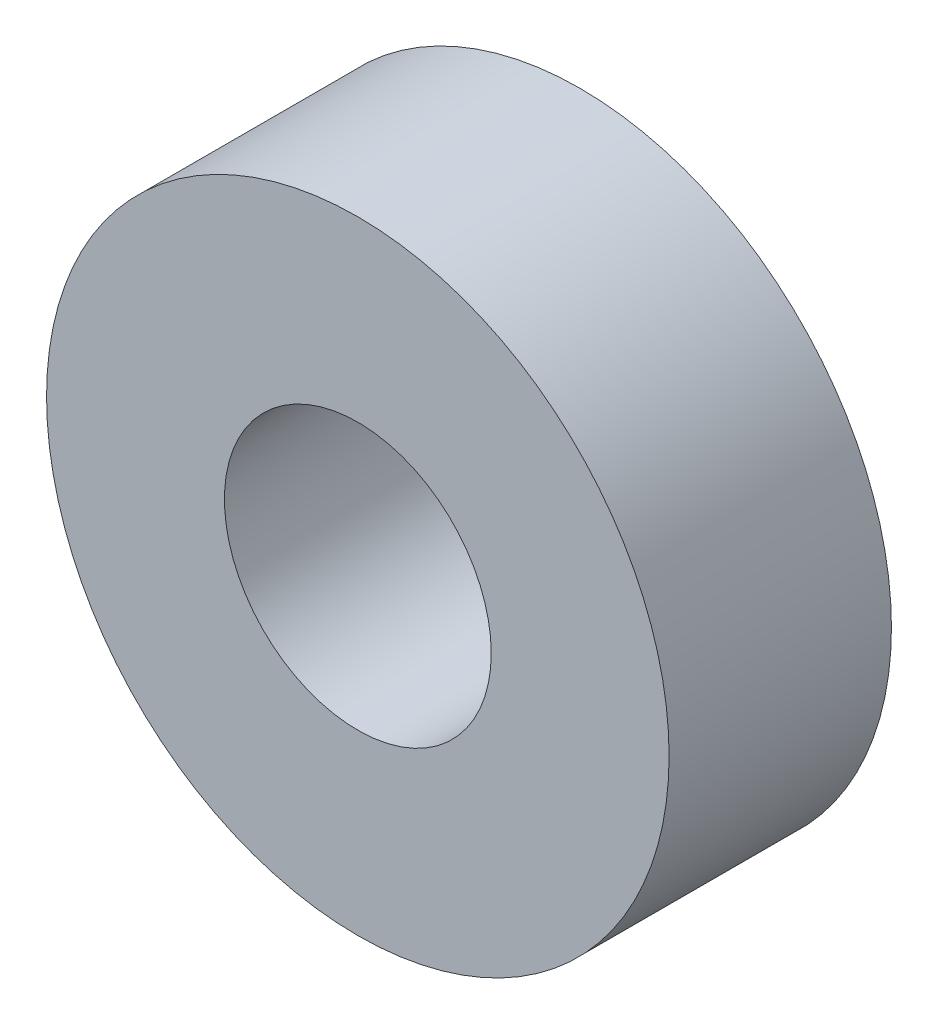
ISO-10303-21;
HEADER;
FILE_DESCRIPTION(('STEP AP214'),'2;1');
FILE_NAME('part.step','',(''),(''),'','','');
FILE_SCHEMA(('AUTOMOTIVE_DESIGN { 1 0 10303 214 1 1 1 1 }'));
ENDSEC;
DATA;
#1=APPLICATION_CONTEXT('core data for automotive mechanical design processes');
#2=APPLICATION_PROTOCOL_DEFINITION('international standard','automotive_design',2000,#1);
#3=PRODUCT_CONTEXT('',#1,'mechanical');
#4=PRODUCT('Part','Part','',(#3));
#5=PRODUCT_RELATED_PRODUCT_CATEGORY('part','',(#4));
#6=PRODUCT_DEFINITION_FORMATION('','',#4);
#7=PRODUCT_DEFINITION_CONTEXT('part definition',#1,'design');
#8=PRODUCT_DEFINITION('design','',#6,#7);
#9=PRODUCT_DEFINITION_SHAPE('','',#8);
#10=(LENGTH_UNIT() NAMED_UNIT(*) SI_UNIT(.MILLI.,.METRE.));
#11=(NAMED_UNIT(*) PLANE_ANGLE_UNIT() SI_UNIT($,.RADIAN.));
#12=(NAMED_UNIT(*) SI_UNIT($,.STERADIAN.) SOLID_ANGLE_UNIT());
#13=UNCERTAINTY_MEASURE_WITH_UNIT(LENGTH_MEASURE(1.E-05),#10,'distance_accuracy_value','');
#14=(GEOMETRIC_REPRESENTATION_CONTEXT(3) GLOBAL_UNCERTAINTY_ASSIGNED_CONTEXT((#13)) GLOBAL_UNIT_ASSIGNED_CONTEXT((#10,
#11,#12)) REPRESENTATION_CONTEXT('',''));
#15=CARTESIAN_POINT('',(0.,0.,0.));
#16=DIRECTION('',(0.,0.,1.));
#17=DIRECTION('',(1.,0.,0.));
#18=AXIS2_PLACEMENT_3D('',#15,#16,#17);
#19=CARTESIAN_POINT('',(0.,0.,2.5));
#20=DIRECTION('',(0.,0.,1.));
#21=DIRECTION('',(1.,0.,0.));
#22=AXIS2_PLACEMENT_3D('',#19,#20,#21);
#23=PLANE('',#22);
#24=CARTESIAN_POINT('',(0.,0.,2.5));
#25=DIRECTION('',(0.,0.,1.));
#26=DIRECTION('',(1.,0.,0.));
#27=AXIS2_PLACEMENT_3D('',#24,#25,#26);
#28=CIRCLE('',#27,7.);
#29=CARTESIAN_POINT('',(7.,0.,2.5));
#30=VERTEX_POINT('',#29);
#31=EDGE_CURVE('E10',#30,#30,#28,.T.);
#32=ORIENTED_EDGE('',*,*,#31,.T.);
#33=EDGE_LOOP('',(#32));
#34=FACE_BOUND('',#33,.T.);
#35=CARTESIAN_POINT('',(0.,0.,2.5));
#36=DIRECTION('',(0.,0.,1.));
#37=DIRECTION('',(1.,0.,0.));
#38=AXIS2_PLACEMENT_3D('',#35,#36,#37);
#39=CIRCLE('',#38,3.);
#40=CARTESIAN_POINT('',(3.,0.,2.5));
#41=VERTEX_POINT('',#40);
#42=EDGE_CURVE('E43',#41,#41,#39,.T.);
#43=ORIENTED_EDGE('',*,*,#42,.F.);
#44=EDGE_LOOP('',(#43));
#45=FACE_BOUND('',#44,.T.);
#46=ADVANCED_FACE('F32',(#34,#45),#23,.T.);
#47=CARTESIAN_POINT('',(0.,0.,-2.5));
#48=DIRECTION('',(0.,0.,1.));
#49=DIRECTION('',(1.,0.,0.));
#50=AXIS2_PLACEMENT_3D('',#47,#48,#49);
#51=PLANE('',#50);
#52=CARTESIAN_POINT('',(0.,0.,-2.5));
#53=DIRECTION('',(0.,0.,1.));
#54=DIRECTION('',(1.,0.,0.));
#55=AXIS2_PLACEMENT_3D('',#52,#53,#54);
#56=CIRCLE('',#55,7.);
#57=CARTESIAN_POINT('',(7.,0.,-2.5));
#58=VERTEX_POINT('',#57);
#59=EDGE_CURVE('E36',#58,#58,#56,.T.);
#60=ORIENTED_EDGE('',*,*,#59,.F.);
#61=EDGE_LOOP('',(#60));
#62=FACE_BOUND('',#61,.T.);
#63=CARTESIAN_POINT('',(0.,0.,-2.5));
#64=DIRECTION('',(0.,0.,1.));
#65=DIRECTION('',(1.,0.,0.));
#66=AXIS2_PLACEMENT_3D('',#63,#64,#65);
#67=CIRCLE('',#66,3.);
#68=CARTESIAN_POINT('',(3.,0.,-2.5));
#69=VERTEX_POINT('',#68);
#70=EDGE_CURVE('E45',#69,#69,#67,.T.);
#71=ORIENTED_EDGE('',*,*,#70,.T.);
#72=EDGE_LOOP('',(#71));
#73=FACE_BOUND('',#72,.T.);
#74=ADVANCED_FACE('F55',(#62,#73),#51,.F.);
#75=CARTESIAN_POINT('',(0.,0.,2.5));
#76=DIRECTION('',(0.,0.,-1.));
#77=DIRECTION('',(-1.,0.,0.));
#78=AXIS2_PLACEMENT_3D('',#75,#76,#77);
#79=CYLINDRICAL_SURFACE('',#78,7.);
#80=ORIENTED_EDGE('',*,*,#31,.F.);
#81=EDGE_LOOP('',(#80));
#82=FACE_BOUND('',#81,.T.);
#83=ORIENTED_EDGE('',*,*,#59,.T.);
#84=EDGE_LOOP('',(#83));
#85=FACE_BOUND('',#84,.T.);
#86=ADVANCED_FACE('F34',(#82,#85),#79,.T.);
#87=CARTESIAN_POINT('',(0.,0.,2.5));
#88=DIRECTION('',(0.,0.,-1.));
#89=DIRECTION('',(-1.,0.,0.));
#90=AXIS2_PLACEMENT_3D('',#87,#88,#89);
#91=CYLINDRICAL_SURFACE('',#90,3.);
#92=ORIENTED_EDGE('',*,*,#42,.T.);
#93=EDGE_LOOP('',(#92));
#94=FACE_BOUND('',#93,.T.);
#95=ORIENTED_EDGE('',*,*,#70,.F.);
#96=EDGE_LOOP('',(#95));
#97=FACE_BOUND('',#96,.T.);
#98=ADVANCED_FACE('F51',(#94,#97),#91,.F.);
#99=CLOSED_SHELL('',(#46,#74,#86,#98));
#100=MANIFOLD_SOLID_BREP('B2',#99);
#101=ADVANCED_BREP_SHAPE_REPRESENTATION('',(#18,#100),#14);
#102=SHAPE_DEFINITION_REPRESENTATION(#9,#101);
ENDSEC;
END-ISO-10303-21;
